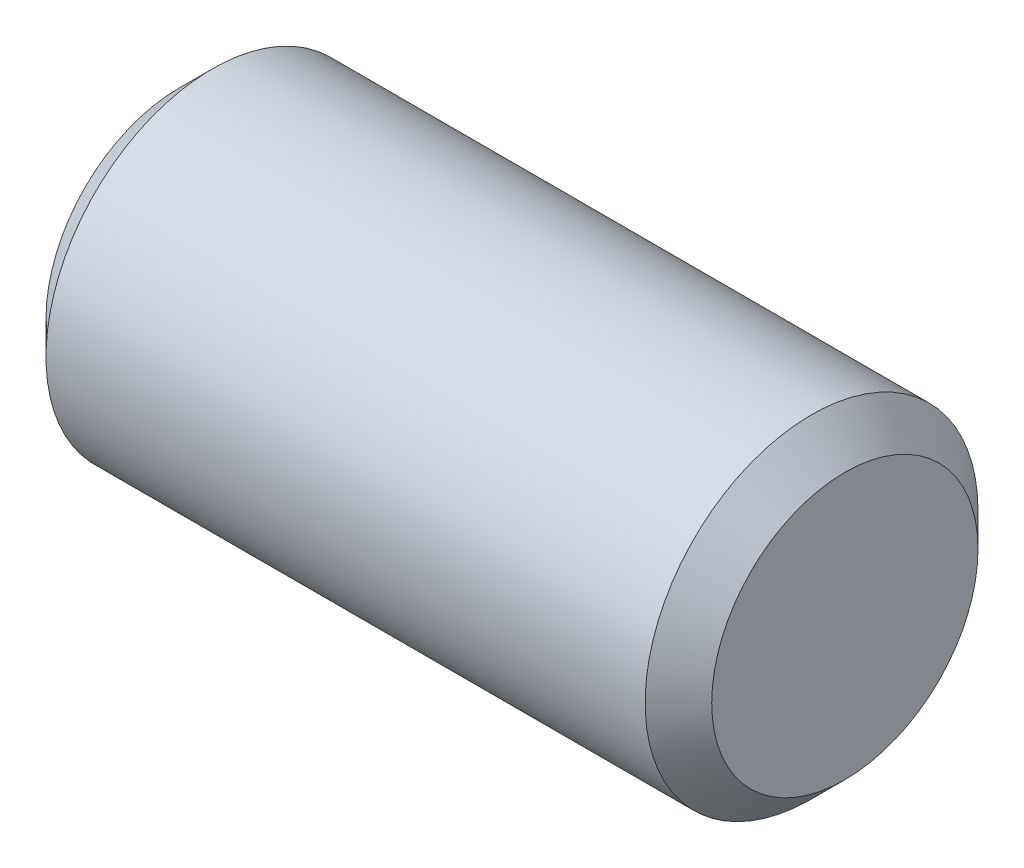
ISO-10303-21;
HEADER;
FILE_DESCRIPTION(('STEP AP214'),'2;1');
FILE_NAME('part.step','',(''),(''),'','','');
FILE_SCHEMA(('AUTOMOTIVE_DESIGN { 1 0 10303 214 1 1 1 1 }'));
ENDSEC;
DATA;
#1=APPLICATION_CONTEXT('core data for automotive mechanical design processes');
#2=APPLICATION_PROTOCOL_DEFINITION('international standard','automotive_design',2000,#1);
#3=PRODUCT_CONTEXT('',#1,'mechanical');
#4=PRODUCT('Part','Part','',(#3));
#5=PRODUCT_RELATED_PRODUCT_CATEGORY('part','',(#4));
#6=PRODUCT_DEFINITION_FORMATION('','',#4);
#7=PRODUCT_DEFINITION_CONTEXT('part definition',#1,'design');
#8=PRODUCT_DEFINITION('design','',#6,#7);
#9=PRODUCT_DEFINITION_SHAPE('','',#8);
#10=(LENGTH_UNIT() NAMED_UNIT(*) SI_UNIT(.MILLI.,.METRE.));
#11=(NAMED_UNIT(*) PLANE_ANGLE_UNIT() SI_UNIT($,.RADIAN.));
#12=(NAMED_UNIT(*) SI_UNIT($,.STERADIAN.) SOLID_ANGLE_UNIT());
#13=UNCERTAINTY_MEASURE_WITH_UNIT(LENGTH_MEASURE(1.E-05),#10,'distance_accuracy_value','');
#14=(GEOMETRIC_REPRESENTATION_CONTEXT(3) GLOBAL_UNCERTAINTY_ASSIGNED_CONTEXT((#13)) GLOBAL_UNIT_ASSIGNED_CONTEXT((#10,
#11,#12)) REPRESENTATION_CONTEXT('',''));
#15=CARTESIAN_POINT('',(0.,0.,0.));
#16=DIRECTION('',(0.,0.,1.));
#17=DIRECTION('',(1.,0.,0.));
#18=AXIS2_PLACEMENT_3D('',#15,#16,#17);
#19=CARTESIAN_POINT('',(-6.35,0.,0.));
#20=DIRECTION('',(1.,0.,0.));
#21=DIRECTION('',(0.,0.,-1.));
#22=AXIS2_PLACEMENT_3D('',#19,#20,#21);
#23=CYLINDRICAL_SURFACE('',#22,3.175);
#24=CARTESIAN_POINT('',(5.71499999999999,0.,0.));
#25=DIRECTION('',(1.,0.,0.));
#26=DIRECTION('',(0.,0.,-1.));
#27=AXIS2_PLACEMENT_3D('',#24,#25,#26);
#28=CIRCLE('',#27,3.175);
#29=CARTESIAN_POINT('',(5.71499999999999,0.,-3.175));
#30=VERTEX_POINT('',#29);
#31=EDGE_CURVE('E37',#30,#30,#28,.F.);
#32=ORIENTED_EDGE('',*,*,#31,.T.);
#33=EDGE_LOOP('',(#32));
#34=FACE_BOUND('',#33,.T.);
#35=CARTESIAN_POINT('',(-5.715,0.,0.));
#36=DIRECTION('',(1.,0.,0.));
#37=DIRECTION('',(0.,0.,-1.));
#38=AXIS2_PLACEMENT_3D('',#35,#36,#37);
#39=CIRCLE('',#38,3.175);
#40=CARTESIAN_POINT('',(-5.715,0.,-3.175));
#41=VERTEX_POINT('',#40);
#42=EDGE_CURVE('E41',#41,#41,#39,.T.);
#43=ORIENTED_EDGE('',*,*,#42,.T.);
#44=EDGE_LOOP('',(#43));
#45=FACE_BOUND('',#44,.T.);
#46=ADVANCED_FACE('F30',(#34,#45),#23,.T.);
#47=CARTESIAN_POINT('',(-6.35,0.,0.));
#48=DIRECTION('',(1.,0.,0.));
#49=DIRECTION('',(0.,0.,-1.));
#50=AXIS2_PLACEMENT_3D('',#47,#48,#49);
#51=PLANE('',#50);
#52=CARTESIAN_POINT('',(-6.35,0.,0.));
#53=DIRECTION('',(1.,0.,0.));
#54=DIRECTION('',(0.,0.,-1.));
#55=AXIS2_PLACEMENT_3D('',#52,#53,#54);
#56=CIRCLE('',#55,2.54);
#57=CARTESIAN_POINT('',(-6.35,0.,-2.54));
#58=VERTEX_POINT('',#57);
#59=EDGE_CURVE('E10',#58,#58,#56,.F.);
#60=ORIENTED_EDGE('',*,*,#59,.T.);
#61=EDGE_LOOP('',(#60));
#62=FACE_BOUND('',#61,.T.);
#63=ADVANCED_FACE('F61',(#62),#51,.F.);
#64=CARTESIAN_POINT('',(6.35,0.,0.));
#65=DIRECTION('',(1.,0.,0.));
#66=DIRECTION('',(0.,0.,-1.));
#67=AXIS2_PLACEMENT_3D('',#64,#65,#66);
#68=PLANE('',#67);
#69=CARTESIAN_POINT('',(6.35,0.,0.));
#70=DIRECTION('',(1.,0.,0.));
#71=DIRECTION('',(0.,0.,-1.));
#72=AXIS2_PLACEMENT_3D('',#69,#70,#71);
#73=CIRCLE('',#72,2.54);
#74=CARTESIAN_POINT('',(6.35,0.,-2.54));
#75=VERTEX_POINT('',#74);
#76=EDGE_CURVE('E45',#75,#75,#73,.T.);
#77=ORIENTED_EDGE('',*,*,#76,.T.);
#78=EDGE_LOOP('',(#77));
#79=FACE_BOUND('',#78,.T.);
#80=ADVANCED_FACE('F51',(#79),#68,.T.);
#81=CARTESIAN_POINT('',(6.35,0.,0.));
#82=DIRECTION('',(-1.,0.,0.));
#83=DIRECTION('',(0.,0.,1.));
#84=AXIS2_PLACEMENT_3D('',#81,#82,#83);
#85=CONICAL_SURFACE('',#84,2.54,0.785398163397446);
#86=ORIENTED_EDGE('',*,*,#31,.F.);
#87=EDGE_LOOP('',(#86));
#88=FACE_BOUND('',#87,.T.);
#89=ORIENTED_EDGE('',*,*,#76,.F.);
#90=EDGE_LOOP('',(#89));
#91=FACE_BOUND('',#90,.T.);
#92=ADVANCED_FACE('F53',(#88,#91),#85,.T.);
#93=CARTESIAN_POINT('',(-5.715,0.,0.));
#94=DIRECTION('',(1.,0.,0.));
#95=DIRECTION('',(0.,0.,-1.));
#96=AXIS2_PLACEMENT_3D('',#93,#94,#95);
#97=CONICAL_SURFACE('',#96,3.175,0.78539816339745);
#98=ORIENTED_EDGE('',*,*,#59,.F.);
#99=EDGE_LOOP('',(#98));
#100=FACE_BOUND('',#99,.T.);
#101=ORIENTED_EDGE('',*,*,#42,.F.);
#102=EDGE_LOOP('',(#101));
#103=FACE_BOUND('',#102,.T.);
#104=ADVANCED_FACE('F32',(#100,#103),#97,.T.);
#105=CLOSED_SHELL('',(#46,#63,#80,#92,#104));
#106=MANIFOLD_SOLID_BREP('B2',#105);
#107=ADVANCED_BREP_SHAPE_REPRESENTATION('',(#18,#106),#14);
#108=SHAPE_DEFINITION_REPRESENTATION(#9,#107);
ENDSEC;
END-ISO-10303-21;
